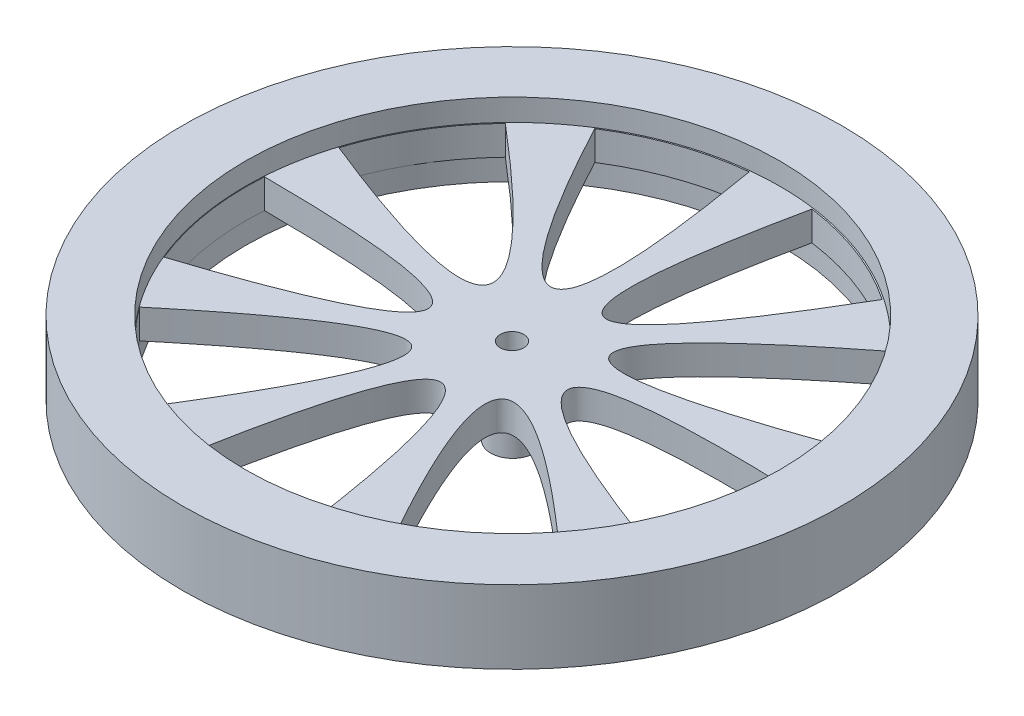
ISO-10303-21;
HEADER;
FILE_DESCRIPTION(('STEP AP214'),'2;1');
FILE_NAME('part.step','',(''),(''),'','','');
FILE_SCHEMA(('AUTOMOTIVE_DESIGN { 1 0 10303 214 1 1 1 1 }'));
ENDSEC;
DATA;
#1=APPLICATION_CONTEXT('core data for automotive mechanical design processes');
#2=APPLICATION_PROTOCOL_DEFINITION('international standard','automotive_design',2000,#1);
#3=PRODUCT_CONTEXT('',#1,'mechanical');
#4=PRODUCT('Part','Part','',(#3));
#5=PRODUCT_RELATED_PRODUCT_CATEGORY('part','',(#4));
#6=PRODUCT_DEFINITION_FORMATION('','',#4);
#7=PRODUCT_DEFINITION_CONTEXT('part definition',#1,'design');
#8=PRODUCT_DEFINITION('design','',#6,#7);
#9=PRODUCT_DEFINITION_SHAPE('','',#8);
#10=(LENGTH_UNIT() NAMED_UNIT(*) SI_UNIT(.MILLI.,.METRE.));
#11=(NAMED_UNIT(*) PLANE_ANGLE_UNIT() SI_UNIT($,.RADIAN.));
#12=(NAMED_UNIT(*) SI_UNIT($,.STERADIAN.) SOLID_ANGLE_UNIT());
#13=UNCERTAINTY_MEASURE_WITH_UNIT(LENGTH_MEASURE(1.E-05),#10,'distance_accuracy_value','');
#14=(GEOMETRIC_REPRESENTATION_CONTEXT(3) GLOBAL_UNCERTAINTY_ASSIGNED_CONTEXT((#13)) GLOBAL_UNIT_ASSIGNED_CONTEXT((#10,
#11,#12)) REPRESENTATION_CONTEXT('',''));
#15=CARTESIAN_POINT('',(0.,0.,0.));
#16=DIRECTION('',(0.,0.,1.));
#17=DIRECTION('',(1.,0.,0.));
#18=AXIS2_PLACEMENT_3D('',#15,#16,#17);
#19=CARTESIAN_POINT('',(0.,5.,0.0887249566365412));
#20=DIRECTION('',(0.,-1.,0.));
#21=DIRECTION('',(0.,0.,-1.));
#22=AXIS2_PLACEMENT_3D('',#19,#20,#21);
#23=CYLINDRICAL_SURFACE('',#22,1.6);
#24=CARTESIAN_POINT('',(0.,-9.8,0.0887249566365412));
#25=DIRECTION('',(0.,-1.,0.));
#26=DIRECTION('',(0.,0.,-1.));
#27=AXIS2_PLACEMENT_3D('',#24,#25,#26);
#28=CIRCLE('',#27,1.6);
#29=CARTESIAN_POINT('',(0.,-9.8,-1.51127504336346));
#30=VERTEX_POINT('',#29);
#31=EDGE_CURVE('E433',#30,#30,#28,.T.);
#32=ORIENTED_EDGE('',*,*,#31,.T.);
#33=EDGE_LOOP('',(#32));
#34=FACE_BOUND('',#33,.T.);
#35=CARTESIAN_POINT('',(0.,2.,0.0887249566365412));
#36=DIRECTION('',(0.,1.,0.));
#37=DIRECTION('',(0.,0.,1.));
#38=AXIS2_PLACEMENT_3D('',#35,#36,#37);
#39=CIRCLE('',#38,1.6);
#40=CARTESIAN_POINT('',(0.,2.,1.68872495663654));
#41=VERTEX_POINT('',#40);
#42=EDGE_CURVE('E472',#41,#41,#39,.T.);
#43=ORIENTED_EDGE('',*,*,#42,.T.);
#44=EDGE_LOOP('',(#43));
#45=FACE_BOUND('',#44,.T.);
#46=ADVANCED_FACE('F44',(#34,#45),#23,.F.);
#47=CARTESIAN_POINT('',(0.,5.,0.0887249566365412));
#48=DIRECTION('',(0.,1.,0.));
#49=DIRECTION('',(0.,0.,1.));
#50=AXIS2_PLACEMENT_3D('',#47,#48,#49);
#51=PLANE('',#50);
#52=CARTESIAN_POINT('',(0.,5.,0.));
#53=DIRECTION('',(0.,1.,0.));
#54=DIRECTION('',(0.,0.,1.));
#55=AXIS2_PLACEMENT_3D('',#52,#53,#54);
#56=CIRCLE('',#55,36.5014809236704);
#57=CARTESIAN_POINT('',(0.,5.,36.5014809236704));
#58=VERTEX_POINT('',#57);
#59=EDGE_CURVE('E461',#58,#58,#56,.T.);
#60=ORIENTED_EDGE('',*,*,#59,.F.);
#61=EDGE_LOOP('',(#60));
#62=FACE_BOUND('',#61,.T.);
#63=CARTESIAN_POINT('',(0.,5.,0.0887249566365412));
#64=DIRECTION('',(0.,1.,0.));
#65=DIRECTION('',(0.,0.,1.));
#66=AXIS2_PLACEMENT_3D('',#63,#64,#65);
#67=CIRCLE('',#66,45.);
#68=CARTESIAN_POINT('',(0.,5.,45.0887249566365));
#69=VERTEX_POINT('',#68);
#70=EDGE_CURVE('E474',#69,#69,#67,.T.);
#71=ORIENTED_EDGE('',*,*,#70,.T.);
#72=EDGE_LOOP('',(#71));
#73=FACE_BOUND('',#72,.T.);
#74=ADVANCED_FACE('F504',(#62,#73),#51,.T.);
#75=CARTESIAN_POINT('',(0.,-5.,0.0887249566365412));
#76=DIRECTION('',(0.,1.,0.));
#77=DIRECTION('',(0.,0.,1.));
#78=AXIS2_PLACEMENT_3D('',#75,#76,#77);
#79=PLANE('',#78);
#80=CARTESIAN_POINT('',(0.,-5.,0.));
#81=DIRECTION('',(0.,-1.,0.));
#82=DIRECTION('',(0.,0.,-1.));
#83=AXIS2_PLACEMENT_3D('',#80,#81,#82);
#84=CIRCLE('',#83,36.5014809236704);
#85=CARTESIAN_POINT('',(0.,-5.,-36.5014809236704));
#86=VERTEX_POINT('',#85);
#87=EDGE_CURVE('E462',#86,#86,#84,.T.);
#88=ORIENTED_EDGE('',*,*,#87,.F.);
#89=EDGE_LOOP('',(#88));
#90=FACE_BOUND('',#89,.T.);
#91=CARTESIAN_POINT('',(0.,-5.,0.0887249566365412));
#92=DIRECTION('',(0.,1.,0.));
#93=DIRECTION('',(0.,0.,1.));
#94=AXIS2_PLACEMENT_3D('',#91,#92,#93);
#95=CIRCLE('',#94,45.);
#96=CARTESIAN_POINT('',(0.,-5.,45.0887249566365));
#97=VERTEX_POINT('',#96);
#98=EDGE_CURVE('E477',#97,#97,#95,.T.);
#99=ORIENTED_EDGE('',*,*,#98,.F.);
#100=EDGE_LOOP('',(#99));
#101=FACE_BOUND('',#100,.T.);
#102=ADVANCED_FACE('F511',(#90,#101),#79,.F.);
#103=CARTESIAN_POINT('',(0.,5.,0.0887249566365412));
#104=DIRECTION('',(0.,-1.,0.));
#105=DIRECTION('',(0.,0.,-1.));
#106=AXIS2_PLACEMENT_3D('',#103,#104,#105);
#107=CYLINDRICAL_SURFACE('',#106,45.);
#108=ORIENTED_EDGE('',*,*,#70,.F.);
#109=EDGE_LOOP('',(#108));
#110=FACE_BOUND('',#109,.T.);
#111=ORIENTED_EDGE('',*,*,#98,.T.);
#112=EDGE_LOOP('',(#111));
#113=FACE_BOUND('',#112,.T.);
#114=ADVANCED_FACE('F46',(#110,#113),#107,.T.);
#115=CARTESIAN_POINT('',(0.,2.,0.));
#116=DIRECTION('',(0.,1.,0.));
#117=DIRECTION('',(0.,0.,1.));
#118=AXIS2_PLACEMENT_3D('',#115,#116,#117);
#119=CYLINDRICAL_SURFACE('',#118,36.5014809236704);
#120=DIRECTION('',(0.,-1.,0.));
#121=VECTOR('',#120,1.);
#122=CARTESIAN_POINT('',(-8.80159725878,8.,35.4244265347417));
#123=LINE('',#122,#121);
#124=CARTESIAN_POINT('',(-8.80159725878,2.,35.4244265347417));
#125=VERTEX_POINT('',#124);
#126=CARTESIAN_POINT('',(-8.80159725878001,-2.,35.4244265347417));
#127=VERTEX_POINT('',#126);
#128=EDGE_CURVE('E446',#125,#127,#123,.T.);
#129=ORIENTED_EDGE('',*,*,#128,.F.);
#130=CARTESIAN_POINT('',(0.,2.,0.));
#131=DIRECTION('',(0.,1.,0.));
#132=DIRECTION('',(0.,0.,1.));
#133=AXIS2_PLACEMENT_3D('',#130,#131,#132);
#134=CIRCLE('',#133,36.5014809236704);
#135=CARTESIAN_POINT('',(7.77143926148394,2.,35.6645880591118));
#136=VERTEX_POINT('',#135);
#137=EDGE_CURVE('E456',#136,#125,#134,.T.);
#138=ORIENTED_EDGE('',*,*,#137,.F.);
#139=DIRECTION('',(0.,-1.,0.));
#140=VECTOR('',#139,1.);
#141=CARTESIAN_POINT('',(7.77143926148394,8.,35.6645880591118));
#142=LINE('',#141,#140);
#143=CARTESIAN_POINT('',(7.77143926148394,-2.,35.6645880591118));
#144=VERTEX_POINT('',#143);
#145=EDGE_CURVE('E443',#136,#144,#142,.T.);
#146=ORIENTED_EDGE('',*,*,#145,.T.);
#147=CARTESIAN_POINT('',(0.,-2.,0.));
#148=DIRECTION('',(0.,-1.,0.));
#149=DIRECTION('',(0.,0.,-1.));
#150=AXIS2_PLACEMENT_3D('',#147,#148,#149);
#151=CIRCLE('',#150,36.5014809236704);
#152=EDGE_CURVE('E444',#127,#144,#151,.T.);
#153=ORIENTED_EDGE('',*,*,#152,.F.);
#154=EDGE_LOOP('',(#129,#138,#146,#153));
#155=FACE_BOUND('',#154,.T.);
#156=ORIENTED_EDGE('',*,*,#59,.T.);
#157=EDGE_LOOP('',(#156));
#158=FACE_BOUND('',#157,.T.);
#159=ORIENTED_EDGE('',*,*,#87,.T.);
#160=EDGE_LOOP('',(#159));
#161=FACE_BOUND('',#160,.T.);
#162=ADVANCED_FACE('F452',(#155,#158,#161),#119,.F.);
#163=CARTESIAN_POINT('',(0.,2.,0.));
#164=DIRECTION('',(0.,1.,0.));
#165=DIRECTION('',(0.,0.,1.));
#166=AXIS2_PLACEMENT_3D('',#163,#164,#165);
#167=PLANE('',#166);
#168=CARTESIAN_POINT('',(-29.4557658246465,2.,21.49988513086));
#169=CARTESIAN_POINT('',(10.6678043736023,2.,-11.8648802067777));
#170=CARTESIAN_POINT('',(-16.9144561448788,2.,32.3368020621628));
#171=B_SPLINE_CURVE_WITH_KNOTS('',2,(#168,#169,#170),.UNSPECIFIED.,.F.,.F.,(3,3),(0.,1.),.UNSPECIFIED.);
#172=CARTESIAN_POINT('',(-16.9144561448788,2.,32.3368020621628));
#173=VERTEX_POINT('',#172);
#174=CARTESIAN_POINT('',(-29.4557658246465,2.,21.49988513086));
#175=VERTEX_POINT('',#174);
#176=EDGE_CURVE('E171',#173,#175,#171,.F.);
#177=ORIENTED_EDGE('',*,*,#176,.F.);
#178=CARTESIAN_POINT('',(0.0570313027959434,2.,0.0207576966391458));
#179=DIRECTION('',(0.,1.,0.));
#180=DIRECTION('',(0.,0.,1.));
#181=AXIS2_PLACEMENT_3D('',#178,#179,#180);
#182=CIRCLE('',#181,36.5014809236704);
#183=EDGE_CURVE('E173',#175,#173,#182,.T.);
#184=ORIENTED_EDGE('',*,*,#183,.F.);
#185=EDGE_LOOP('',(#177,#184));
#186=FACE_BOUND('',#185,.T.);
#187=CARTESIAN_POINT('',(-36.3272541967891,2.,-2.44317607708021));
#188=CARTESIAN_POINT('',(15.8556415508061,2.,-2.21113538012383));
#189=CARTESIAN_POINT('',(-33.6858895378125,2.,13.9197823900828));
#190=B_SPLINE_CURVE_WITH_KNOTS('',2,(#187,#188,#189),.UNSPECIFIED.,.F.,.F.,(3,3),(0.,1.),.UNSPECIFIED.);
#191=CARTESIAN_POINT('',(-33.6858895378125,2.,13.9197823900828));
#192=VERTEX_POINT('',#191);
#193=CARTESIAN_POINT('',(-36.3272541967891,2.,-2.4431760770802));
#194=VERTEX_POINT('',#193);
#195=EDGE_CURVE('E237',#192,#194,#190,.F.);
#196=ORIENTED_EDGE('',*,*,#195,.F.);
#197=CARTESIAN_POINT('',(0.0873770251813376,2.,0.0733180296030275));
#198=DIRECTION('',(0.,1.,0.));
#199=DIRECTION('',(0.,0.,1.));
#200=AXIS2_PLACEMENT_3D('',#197,#198,#199);
#201=CIRCLE('',#200,36.5014809236704);
#202=EDGE_CURVE('E704',#194,#192,#201,.T.);
#203=ORIENTED_EDGE('',*,*,#202,.F.);
#204=EDGE_LOOP('',(#196,#203));
#205=FACE_BOUND('',#204,.T.);
#206=CARTESIAN_POINT('',(-26.2008165977952,2.,-25.2015326523988));
#207=CARTESIAN_POINT('',(13.6244478305604,2.,8.51873965820074));
#208=CARTESIAN_POINT('',(-34.6953208390431,2.,-10.9689427701879));
#209=B_SPLINE_CURVE_WITH_KNOTS('',2,(#206,#207,#208),.UNSPECIFIED.,.F.,.F.,(3,3),(0.,1.),.UNSPECIFIED.);
#210=CARTESIAN_POINT('',(-34.6953208390431,2.,-10.9689427701879));
#211=VERTEX_POINT('',#210);
#212=CARTESIAN_POINT('',(-26.2008165977952,2.,-25.2015326523987));
#213=VERTEX_POINT('',#212);
#214=EDGE_CURVE('E261',#211,#213,#209,.F.);
#215=ORIENTED_EDGE('',*,*,#214,.F.);
#216=CARTESIAN_POINT('',(0.0768380663969178,2.,0.133087434954811));
#217=DIRECTION('',(0.,1.,0.));
#218=DIRECTION('',(0.,0.,1.));
#219=AXIS2_PLACEMENT_3D('',#216,#217,#218);
#220=CIRCLE('',#219,36.5014809236704);
#221=EDGE_CURVE('E257',#213,#211,#220,.T.);
#222=ORIENTED_EDGE('',*,*,#221,.F.);
#223=EDGE_LOOP('',(#215,#222));
#224=FACE_BOUND('',#223,.T.);
#225=CARTESIAN_POINT('',(-3.81472572305179,2.,-36.1262966225446));
#226=CARTESIAN_POINT('',(5.01822355152437,2.,15.304117128486));
#227=CARTESIAN_POINT('',(-19.4704259241455,2.,-30.6836623087895));
#228=B_SPLINE_CURVE_WITH_KNOTS('',2,(#225,#226,#227),.UNSPECIFIED.,.F.,.F.,(3,3),(0.,1.),.UNSPECIFIED.);
#229=CARTESIAN_POINT('',(-19.4704259241455,2.,-30.6836623087895));
#230=VERTEX_POINT('',#229);
#231=CARTESIAN_POINT('',(-3.8147257230518,2.,-36.1262966225446));
#232=VERTEX_POINT('',#231);
#233=EDGE_CURVE('E300',#230,#232,#228,.F.);
#234=ORIENTED_EDGE('',*,*,#233,.F.);
#235=CARTESIAN_POINT('',(0.0303457223853942,2.,0.172099143667448));
#236=DIRECTION('',(0.,1.,0.));
#237=DIRECTION('',(0.,0.,1.));
#238=AXIS2_PLACEMENT_3D('',#235,#236,#237);
#239=CIRCLE('',#238,36.5014809236704);
#240=EDGE_CURVE('E772',#232,#230,#239,.T.);
#241=ORIENTED_EDGE('',*,*,#240,.F.);
#242=EDGE_LOOP('',(#234,#241));
#243=FACE_BOUND('',#242,.T.);
#244=CARTESIAN_POINT('',(20.3563177134615,2.,-30.1056495106592));
#245=CARTESIAN_POINT('',(-5.93608329861239,2.,14.9700435013149));
#246=CARTESIAN_POINT('',(4.86489767034039,2.,-35.9996398489086));
#247=B_SPLINE_CURVE_WITH_KNOTS('',2,(#244,#245,#246),.UNSPECIFIED.,.F.,.F.,(3,3),(0.,1.),.UNSPECIFIED.);
#248=CARTESIAN_POINT('',(4.86489767034039,2.,-35.9996398489086));
#249=VERTEX_POINT('',#248);
#250=CARTESIAN_POINT('',(20.3563177134614,2.,-30.1056495106592));
#251=VERTEX_POINT('',#250);
#252=EDGE_CURVE('E324',#249,#251,#247,.F.);
#253=ORIENTED_EDGE('',*,*,#252,.F.);
#254=CARTESIAN_POINT('',(-0.0303457223853931,2.,0.172099143667449));
#255=DIRECTION('',(0.,1.,0.));
#256=DIRECTION('',(0.,0.,1.));
#257=AXIS2_PLACEMENT_3D('',#254,#255,#256);
#258=CIRCLE('',#257,36.5014809236704);
#259=EDGE_CURVE('E320',#251,#249,#258,.T.);
#260=ORIENTED_EDGE('',*,*,#259,.F.);
#261=EDGE_LOOP('',(#253,#260));
#262=FACE_BOUND('',#261,.T.);
#263=CARTESIAN_POINT('',(35.0024138565749,2.,-9.95671901243322));
#264=CARTESIAN_POINT('',(-14.1128308011111,2.,7.6728355396555));
#265=CARTESIAN_POINT('',(26.923881577559,2.,-24.4294704190141));
#266=B_SPLINE_CURVE_WITH_KNOTS('',2,(#263,#264,#265),.UNSPECIFIED.,.F.,.F.,(3,3),(0.,1.),.UNSPECIFIED.);
#267=CARTESIAN_POINT('',(26.923881577559,2.,-24.4294704190141));
#268=VERTEX_POINT('',#267);
#269=CARTESIAN_POINT('',(35.0024138565749,2.,-9.95671901243323));
#270=VERTEX_POINT('',#269);
#271=EDGE_CURVE('E363',#268,#270,#266,.F.);
#272=ORIENTED_EDGE('',*,*,#271,.F.);
#273=CARTESIAN_POINT('',(-0.0768380663969172,2.,0.133087434954812));
#274=DIRECTION('',(0.,1.,0.));
#275=DIRECTION('',(0.,0.,1.));
#276=AXIS2_PLACEMENT_3D('',#273,#274,#275);
#277=CIRCLE('',#276,36.5014809236704);
#278=EDGE_CURVE('E756',#270,#268,#277,.T.);
#279=ORIENTED_EDGE('',*,*,#278,.F.);
#280=EDGE_LOOP('',(#272,#279));
#281=FACE_BOUND('',#280,.T.);
#282=CARTESIAN_POINT('',(33.2704915476983,2.,14.8925863615944));
#283=CARTESIAN_POINT('',(-15.6860279251267,2.,-3.17306205179878));
#284=CARTESIAN_POINT('',(36.3848820690245,2.,-1.38696488346341));
#285=B_SPLINE_CURVE_WITH_KNOTS('',2,(#282,#283,#284),.UNSPECIFIED.,.F.,.F.,(3,3),(0.,1.),.UNSPECIFIED.);
#286=CARTESIAN_POINT('',(36.3848820690245,2.,-1.38696488346341));
#287=VERTEX_POINT('',#286);
#288=CARTESIAN_POINT('',(33.2704915476983,2.,14.8925863615944));
#289=VERTEX_POINT('',#288);
#290=EDGE_CURVE('E387',#287,#289,#285,.F.);
#291=ORIENTED_EDGE('',*,*,#290,.F.);
#292=CARTESIAN_POINT('',(-0.0873770251813378,2.,0.0733180296030287));
#293=DIRECTION('',(0.,1.,0.));
#294=DIRECTION('',(0.,0.,1.));
#295=AXIS2_PLACEMENT_3D('',#292,#293,#294);
#296=CIRCLE('',#295,36.5014809236704);
#297=EDGE_CURVE('E383',#289,#287,#296,.T.);
#298=ORIENTED_EDGE('',*,*,#297,.F.);
#299=EDGE_LOOP('',(#291,#298));
#300=FACE_BOUND('',#299,.T.);
#301=CARTESIAN_POINT('',(15.9709364833275,2.,32.8150004576493));
#302=CARTESIAN_POINT('',(-9.91955825219364,2.,-12.4927332512815));
#303=CARTESIAN_POINT('',(28.8209918674721,2.,22.3460323287358));
#304=B_SPLINE_CURVE_WITH_KNOTS('',2,(#301,#302,#303),.UNSPECIFIED.,.F.,.F.,(3,3),(0.,1.),.UNSPECIFIED.);
#305=CARTESIAN_POINT('',(28.8209918674721,2.,22.3460323287358));
#306=VERTEX_POINT('',#305);
#307=CARTESIAN_POINT('',(15.9709364833275,2.,32.8150004576492));
#308=VERTEX_POINT('',#307);
#309=EDGE_CURVE('E422',#306,#308,#304,.F.);
#310=ORIENTED_EDGE('',*,*,#309,.F.);
#311=CARTESIAN_POINT('',(-0.0570313027959443,2.,0.0207576966391466));
#312=DIRECTION('',(0.,1.,0.));
#313=DIRECTION('',(0.,0.,1.));
#314=AXIS2_PLACEMENT_3D('',#311,#312,#313);
#315=CIRCLE('',#314,36.5014809236704);
#316=EDGE_CURVE('E740',#308,#306,#315,.T.);
#317=ORIENTED_EDGE('',*,*,#316,.F.);
#318=EDGE_LOOP('',(#310,#317));
#319=FACE_BOUND('',#318,.T.);
#320=CARTESIAN_POINT('',(-8.80159725878001,2.,35.4244265347417));
#321=CARTESIAN_POINT('',(0.488382970550821,2.,-15.9254003279467));
#322=CARTESIAN_POINT('',(7.77143926148394,2.,35.6645880591118));
#323=B_SPLINE_CURVE_WITH_KNOTS('',2,(#320,#321,#322),.UNSPECIFIED.,.F.,.F.,(3,3),(0.,1.),.UNSPECIFIED.);
#324=EDGE_CURVE('E12',#136,#125,#323,.F.);
#325=ORIENTED_EDGE('',*,*,#324,.F.);
#326=ORIENTED_EDGE('',*,*,#137,.T.);
#327=EDGE_LOOP('',(#325,#326));
#328=FACE_BOUND('',#327,.T.);
#329=ORIENTED_EDGE('',*,*,#42,.F.);
#330=EDGE_LOOP('',(#329));
#331=FACE_BOUND('',#330,.T.);
#332=ADVANCED_FACE('F494',(#186,#205,#224,#243,#262,#281,#300,#319,#328,#331),#167,.T.);
#333=CARTESIAN_POINT('',(0.,-2.,0.));
#334=DIRECTION('',(0.,-1.,0.));
#335=DIRECTION('',(0.,0.,-1.));
#336=AXIS2_PLACEMENT_3D('',#333,#334,#335);
#337=PLANE('',#336);
#338=CARTESIAN_POINT('',(-29.4557658246465,-2.,21.49988513086));
#339=CARTESIAN_POINT('',(10.6678043736023,-2.,-11.8648802067777));
#340=CARTESIAN_POINT('',(-16.9144561448788,-2.,32.3368020621628));
#341=B_SPLINE_CURVE_WITH_KNOTS('',2,(#338,#339,#340),.UNSPECIFIED.,.F.,.F.,(3,3),(0.,1.),.UNSPECIFIED.);
#342=CARTESIAN_POINT('',(-29.4557658246465,-2.,21.49988513086));
#343=VERTEX_POINT('',#342);
#344=CARTESIAN_POINT('',(-16.9144561448788,-2.,32.3368020621628));
#345=VERTEX_POINT('',#344);
#346=EDGE_CURVE('E68',#343,#345,#341,.T.);
#347=ORIENTED_EDGE('',*,*,#346,.F.);
#348=CARTESIAN_POINT('',(0.0570313027959434,-2.,0.0207576966391458));
#349=DIRECTION('',(0.,-1.,0.));
#350=DIRECTION('',(0.64278760968653,0.,-0.766044443118986));
#351=AXIS2_PLACEMENT_3D('',#348,#349,#350);
#352=CIRCLE('',#351,36.5014809236704);
#353=EDGE_CURVE('E177',#345,#343,#352,.T.);
#354=ORIENTED_EDGE('',*,*,#353,.F.);
#355=EDGE_LOOP('',(#347,#354));
#356=FACE_BOUND('',#355,.T.);
#357=CARTESIAN_POINT('',(-36.3272541967891,-2.,-2.44317607708021));
#358=CARTESIAN_POINT('',(15.8556415508061,-2.,-2.21113538012383));
#359=CARTESIAN_POINT('',(-33.6858895378125,-2.,13.9197823900828));
#360=B_SPLINE_CURVE_WITH_KNOTS('',2,(#357,#358,#359),.UNSPECIFIED.,.F.,.F.,(3,3),(0.,1.),.UNSPECIFIED.);
#361=CARTESIAN_POINT('',(-36.3272541967891,-2.,-2.4431760770802));
#362=VERTEX_POINT('',#361);
#363=CARTESIAN_POINT('',(-33.6858895378125,-2.,13.9197823900828));
#364=VERTEX_POINT('',#363);
#365=EDGE_CURVE('E199',#362,#364,#360,.T.);
#366=ORIENTED_EDGE('',*,*,#365,.F.);
#367=CARTESIAN_POINT('',(0.0873770251813376,-2.,0.0733180296030275));
#368=DIRECTION('',(0.,-1.,0.));
#369=DIRECTION('',(0.984807753012206,0.,-0.17364817766694));
#370=AXIS2_PLACEMENT_3D('',#367,#368,#369);
#371=CIRCLE('',#370,36.5014809236704);
#372=EDGE_CURVE('E714',#364,#362,#371,.T.);
#373=ORIENTED_EDGE('',*,*,#372,.F.);
#374=EDGE_LOOP('',(#366,#373));
#375=FACE_BOUND('',#374,.T.);
#376=CARTESIAN_POINT('',(-26.2008165977952,-2.,-25.2015326523988));
#377=CARTESIAN_POINT('',(13.6244478305604,-2.,8.51873965820074));
#378=CARTESIAN_POINT('',(-34.6953208390431,-2.,-10.9689427701879));
#379=B_SPLINE_CURVE_WITH_KNOTS('',2,(#376,#377,#378),.UNSPECIFIED.,.F.,.F.,(3,3),(0.,1.),.UNSPECIFIED.);
#380=CARTESIAN_POINT('',(-26.2008165977952,-2.,-25.2015326523987));
#381=VERTEX_POINT('',#380);
#382=CARTESIAN_POINT('',(-34.6953208390431,-2.,-10.9689427701879));
#383=VERTEX_POINT('',#382);
#384=EDGE_CURVE('E241',#381,#383,#379,.T.);
#385=ORIENTED_EDGE('',*,*,#384,.F.);
#386=CARTESIAN_POINT('',(0.0768380663969178,-2.,0.133087434954811));
#387=DIRECTION('',(0.,-1.,0.));
#388=DIRECTION('',(0.866025403784443,0.,0.499999999999992));
#389=AXIS2_PLACEMENT_3D('',#386,#387,#388);
#390=CIRCLE('',#389,36.5014809236704);
#391=EDGE_CURVE('E248',#383,#381,#390,.T.);
#392=ORIENTED_EDGE('',*,*,#391,.F.);
#393=EDGE_LOOP('',(#385,#392));
#394=FACE_BOUND('',#393,.T.);
#395=CARTESIAN_POINT('',(-3.81472572305179,-2.,-36.1262966225446));
#396=CARTESIAN_POINT('',(5.01822355152437,-2.,15.304117128486));
#397=CARTESIAN_POINT('',(-19.4704259241455,-2.,-30.6836623087895));
#398=B_SPLINE_CURVE_WITH_KNOTS('',2,(#395,#396,#397),.UNSPECIFIED.,.F.,.F.,(3,3),(0.,1.),.UNSPECIFIED.);
#399=CARTESIAN_POINT('',(-3.8147257230518,-2.,-36.1262966225446));
#400=VERTEX_POINT('',#399);
#401=CARTESIAN_POINT('',(-19.4704259241455,-2.,-30.6836623087895));
#402=VERTEX_POINT('',#401);
#403=EDGE_CURVE('E266',#400,#402,#398,.T.);
#404=ORIENTED_EDGE('',*,*,#403,.F.);
#405=CARTESIAN_POINT('',(0.0303457223853942,-2.,0.172099143667448));
#406=DIRECTION('',(0.,-1.,0.));
#407=DIRECTION('',(0.342020143325676,0.,0.939692620785906));
#408=AXIS2_PLACEMENT_3D('',#405,#406,#407);
#409=CIRCLE('',#408,36.5014809236704);
#410=EDGE_CURVE('E779',#402,#400,#409,.T.);
#411=ORIENTED_EDGE('',*,*,#410,.F.);
#412=EDGE_LOOP('',(#404,#411));
#413=FACE_BOUND('',#412,.T.);
#414=CARTESIAN_POINT('',(20.3563177134615,-2.,-30.1056495106592));
#415=CARTESIAN_POINT('',(-5.93608329861239,-2.,14.9700435013149));
#416=CARTESIAN_POINT('',(4.86489767034039,-2.,-35.9996398489086));
#417=B_SPLINE_CURVE_WITH_KNOTS('',2,(#414,#415,#416),.UNSPECIFIED.,.F.,.F.,(3,3),(0.,1.),.UNSPECIFIED.);
#418=CARTESIAN_POINT('',(20.3563177134614,-2.,-30.1056495106592));
#419=VERTEX_POINT('',#418);
#420=CARTESIAN_POINT('',(4.86489767034039,-2.,-35.9996398489086));
#421=VERTEX_POINT('',#420);
#422=EDGE_CURVE('E304',#419,#421,#417,.T.);
#423=ORIENTED_EDGE('',*,*,#422,.F.);
#424=CARTESIAN_POINT('',(-0.0303457223853931,-2.,0.172099143667449));
#425=DIRECTION('',(0.,-1.,0.));
#426=DIRECTION('',(-0.342020143325663,0.,0.939692620785911));
#427=AXIS2_PLACEMENT_3D('',#424,#425,#426);
#428=CIRCLE('',#427,36.5014809236704);
#429=EDGE_CURVE('E311',#421,#419,#428,.T.);
#430=ORIENTED_EDGE('',*,*,#429,.F.);
#431=EDGE_LOOP('',(#423,#430));
#432=FACE_BOUND('',#431,.T.);
#433=CARTESIAN_POINT('',(35.0024138565749,-2.,-9.95671901243322));
#434=CARTESIAN_POINT('',(-14.1128308011111,-2.,7.6728355396555));
#435=CARTESIAN_POINT('',(26.923881577559,-2.,-24.4294704190141));
#436=B_SPLINE_CURVE_WITH_KNOTS('',2,(#433,#434,#435),.UNSPECIFIED.,.F.,.F.,(3,3),(0.,1.),.UNSPECIFIED.);
#437=CARTESIAN_POINT('',(35.0024138565749,-2.,-9.95671901243323));
#438=VERTEX_POINT('',#437);
#439=CARTESIAN_POINT('',(26.923881577559,-2.,-24.4294704190141));
#440=VERTEX_POINT('',#439);
#441=EDGE_CURVE('E329',#438,#440,#436,.T.);
#442=ORIENTED_EDGE('',*,*,#441,.F.);
#443=CARTESIAN_POINT('',(-0.0768380663969172,-2.,0.133087434954812));
#444=DIRECTION('',(0.,-1.,0.));
#445=DIRECTION('',(-0.866025403784436,0.,0.500000000000004));
#446=AXIS2_PLACEMENT_3D('',#443,#444,#445);
#447=CIRCLE('',#446,36.5014809236704);
#448=EDGE_CURVE('E763',#440,#438,#447,.T.);
#449=ORIENTED_EDGE('',*,*,#448,.F.);
#450=EDGE_LOOP('',(#442,#449));
#451=FACE_BOUND('',#450,.T.);
#452=CARTESIAN_POINT('',(33.2704915476983,-2.,14.8925863615944));
#453=CARTESIAN_POINT('',(-15.6860279251267,-2.,-3.17306205179878));
#454=CARTESIAN_POINT('',(36.3848820690245,-2.,-1.38696488346341));
#455=B_SPLINE_CURVE_WITH_KNOTS('',2,(#452,#453,#454),.UNSPECIFIED.,.F.,.F.,(3,3),(0.,1.),.UNSPECIFIED.);
#456=CARTESIAN_POINT('',(33.2704915476983,-2.,14.8925863615944));
#457=VERTEX_POINT('',#456);
#458=CARTESIAN_POINT('',(36.3848820690245,-2.,-1.38696488346341));
#459=VERTEX_POINT('',#458);
#460=EDGE_CURVE('E367',#457,#459,#455,.T.);
#461=ORIENTED_EDGE('',*,*,#460,.F.);
#462=CARTESIAN_POINT('',(-0.0873770251813378,-2.,0.0733180296030287));
#463=DIRECTION('',(0.,-1.,0.));
#464=DIRECTION('',(-0.984807753012209,0.,-0.173648177666927));
#465=AXIS2_PLACEMENT_3D('',#462,#463,#464);
#466=CIRCLE('',#465,36.5014809236704);
#467=EDGE_CURVE('E374',#459,#457,#466,.T.);
#468=ORIENTED_EDGE('',*,*,#467,.F.);
#469=EDGE_LOOP('',(#461,#468));
#470=FACE_BOUND('',#469,.T.);
#471=CARTESIAN_POINT('',(15.9709364833275,-2.,32.8150004576493));
#472=CARTESIAN_POINT('',(-9.91955825219364,-2.,-12.4927332512815));
#473=CARTESIAN_POINT('',(28.8209918674721,-2.,22.3460323287358));
#474=B_SPLINE_CURVE_WITH_KNOTS('',2,(#471,#472,#473),.UNSPECIFIED.,.F.,.F.,(3,3),(0.,1.),.UNSPECIFIED.);
#475=CARTESIAN_POINT('',(15.9709364833275,-2.,32.8150004576493));
#476=VERTEX_POINT('',#475);
#477=CARTESIAN_POINT('',(28.8209918674721,-2.,22.3460323287358));
#478=VERTEX_POINT('',#477);
#479=EDGE_CURVE('E392',#476,#478,#474,.T.);
#480=ORIENTED_EDGE('',*,*,#479,.F.);
#481=CARTESIAN_POINT('',(-0.0570313027959443,-2.,0.0207576966391466));
#482=DIRECTION('',(0.,-1.,0.));
#483=DIRECTION('',(-0.642787609686541,0.,-0.766044443118977));
#484=AXIS2_PLACEMENT_3D('',#481,#482,#483);
#485=CIRCLE('',#484,36.5014809236704);
#486=EDGE_CURVE('E747',#478,#476,#485,.T.);
#487=ORIENTED_EDGE('',*,*,#486,.F.);
#488=EDGE_LOOP('',(#480,#487));
#489=FACE_BOUND('',#488,.T.);
#490=CARTESIAN_POINT('',(-8.80159725878001,-2.,35.4244265347417));
#491=CARTESIAN_POINT('',(0.488382970550821,-2.,-15.9254003279467));
#492=CARTESIAN_POINT('',(7.77143926148394,-2.,35.6645880591118));
#493=B_SPLINE_CURVE_WITH_KNOTS('',2,(#490,#491,#492),.UNSPECIFIED.,.F.,.F.,(3,3),(0.,1.),.UNSPECIFIED.);
#494=EDGE_CURVE('E439',#127,#144,#493,.T.);
#495=ORIENTED_EDGE('',*,*,#494,.F.);
#496=ORIENTED_EDGE('',*,*,#152,.T.);
#497=EDGE_LOOP('',(#495,#496));
#498=FACE_BOUND('',#497,.T.);
#499=CARTESIAN_POINT('',(0.,-2.,0.));
#500=DIRECTION('',(0.,-1.,0.));
#501=DIRECTION('',(0.,0.,-1.));
#502=AXIS2_PLACEMENT_3D('',#499,#500,#501);
#503=CIRCLE('',#502,3.);
#504=CARTESIAN_POINT('',(0.,-2.,-3.));
#505=VERTEX_POINT('',#504);
#506=EDGE_CURVE('E53',#505,#505,#503,.T.);
#507=ORIENTED_EDGE('',*,*,#506,.F.);
#508=EDGE_LOOP('',(#507));
#509=FACE_BOUND('',#508,.T.);
#510=ADVANCED_FACE('F181',(#356,#375,#394,#413,#432,#451,#470,#489,#498,#509),#337,.T.);
#511=CARTESIAN_POINT('',(0.,-1.,0.));
#512=DIRECTION('',(0.,-1.,0.));
#513=DIRECTION('',(0.,0.,-1.));
#514=AXIS2_PLACEMENT_3D('',#511,#512,#513);
#515=CYLINDRICAL_SURFACE('',#514,3.);
#516=ORIENTED_EDGE('',*,*,#506,.T.);
#517=EDGE_LOOP('',(#516));
#518=FACE_BOUND('',#517,.T.);
#519=CARTESIAN_POINT('',(0.,-9.8,0.));
#520=DIRECTION('',(0.,-1.,0.));
#521=DIRECTION('',(0.,0.,-1.));
#522=AXIS2_PLACEMENT_3D('',#519,#520,#521);
#523=CIRCLE('',#522,3.);
#524=CARTESIAN_POINT('',(0.,-9.8,-3.));
#525=VERTEX_POINT('',#524);
#526=EDGE_CURVE('E466',#525,#525,#523,.T.);
#527=ORIENTED_EDGE('',*,*,#526,.F.);
#528=EDGE_LOOP('',(#527));
#529=FACE_BOUND('',#528,.T.);
#530=ADVANCED_FACE('F491',(#518,#529),#515,.T.);
#531=CARTESIAN_POINT('',(0.,-9.8,0.));
#532=DIRECTION('',(0.,-1.,0.));
#533=DIRECTION('',(0.,0.,-1.));
#534=AXIS2_PLACEMENT_3D('',#531,#532,#533);
#535=PLANE('',#534);
#536=ORIENTED_EDGE('',*,*,#526,.T.);
#537=EDGE_LOOP('',(#536));
#538=FACE_BOUND('',#537,.T.);
#539=ORIENTED_EDGE('',*,*,#31,.F.);
#540=EDGE_LOOP('',(#539));
#541=FACE_BOUND('',#540,.T.);
#542=ADVANCED_FACE('F414',(#538,#541),#535,.T.);
#543=CARTESIAN_POINT('',(-8.80159725878001,8.,35.4244265347417));
#544=CARTESIAN_POINT('',(0.488382970550821,8.,-15.9254003279467));
#545=CARTESIAN_POINT('',(7.77143926148394,8.,35.6645880591118));
#546=B_SPLINE_CURVE_WITH_KNOTS('',2,(#543,#544,#545),.UNSPECIFIED.,.F.,.F.,(3,3),(0.,1.),.UNSPECIFIED.);
#547=DIRECTION('',(0.,-1.,0.));
#548=VECTOR('',#547,1.);
#549=SURFACE_OF_LINEAR_EXTRUSION('',#546,#548);
#550=ORIENTED_EDGE('',*,*,#324,.T.);
#551=ORIENTED_EDGE('',*,*,#128,.T.);
#552=ORIENTED_EDGE('',*,*,#494,.T.);
#553=ORIENTED_EDGE('',*,*,#145,.F.);
#554=EDGE_LOOP('',(#550,#551,#552,#553));
#555=FACE_BOUND('',#554,.T.);
#556=ADVANCED_FACE('F409',(#555),#549,.F.);
#557=CARTESIAN_POINT('',(15.9709364833275,8.,32.8150004576493));
#558=CARTESIAN_POINT('',(-9.91955825219364,8.,-12.4927332512815));
#559=CARTESIAN_POINT('',(28.8209918674721,8.,22.3460323287358));
#560=B_SPLINE_CURVE_WITH_KNOTS('',2,(#557,#558,#559),.UNSPECIFIED.,.F.,.F.,(3,3),(0.,1.),.UNSPECIFIED.);
#561=DIRECTION('',(0.,-1.,0.));
#562=VECTOR('',#561,1.);
#563=SURFACE_OF_LINEAR_EXTRUSION('',#560,#562);
#564=ORIENTED_EDGE('',*,*,#309,.T.);
#565=DIRECTION('',(0.,-1.,0.));
#566=VECTOR('',#565,1.);
#567=CARTESIAN_POINT('',(15.9709364833275,8.,32.8150004576493));
#568=LINE('',#567,#566);
#569=EDGE_CURVE('E742',#308,#476,#568,.T.);
#570=ORIENTED_EDGE('',*,*,#569,.T.);
#571=ORIENTED_EDGE('',*,*,#479,.T.);
#572=DIRECTION('',(0.,-1.,0.));
#573=VECTOR('',#572,1.);
#574=CARTESIAN_POINT('',(28.8209918674721,8.,22.3460323287358));
#575=LINE('',#574,#573);
#576=EDGE_CURVE('E744',#306,#478,#575,.T.);
#577=ORIENTED_EDGE('',*,*,#576,.F.);
#578=EDGE_LOOP('',(#564,#570,#571,#577));
#579=FACE_BOUND('',#578,.T.);
#580=ADVANCED_FACE('F406',(#579),#563,.F.);
#581=CARTESIAN_POINT('',(-0.0570313027959443,8.,0.0207576966391466));
#582=DIRECTION('',(0.,-1.,0.));
#583=DIRECTION('',(0.,0.,-1.));
#584=AXIS2_PLACEMENT_3D('',#581,#582,#583);
#585=CYLINDRICAL_SURFACE('',#584,36.5014809236704);
#586=ORIENTED_EDGE('',*,*,#316,.T.);
#587=ORIENTED_EDGE('',*,*,#576,.T.);
#588=ORIENTED_EDGE('',*,*,#486,.T.);
#589=ORIENTED_EDGE('',*,*,#569,.F.);
#590=EDGE_LOOP('',(#586,#587,#588,#589));
#591=FACE_BOUND('',#590,.T.);
#592=ADVANCED_FACE('F355',(#591),#585,.F.);
#593=CARTESIAN_POINT('',(33.2704915476983,8.,14.8925863615944));
#594=CARTESIAN_POINT('',(-15.6860279251267,8.,-3.17306205179878));
#595=CARTESIAN_POINT('',(36.3848820690245,8.,-1.38696488346341));
#596=B_SPLINE_CURVE_WITH_KNOTS('',2,(#593,#594,#595),.UNSPECIFIED.,.F.,.F.,(3,3),(0.,1.),.UNSPECIFIED.);
#597=DIRECTION('',(0.,-1.,0.));
#598=VECTOR('',#597,1.);
#599=SURFACE_OF_LINEAR_EXTRUSION('',#596,#598);
#600=ORIENTED_EDGE('',*,*,#290,.T.);
#601=DIRECTION('',(0.,-1.,0.));
#602=VECTOR('',#601,1.);
#603=CARTESIAN_POINT('',(33.2704915476983,8.,14.8925863615944));
#604=LINE('',#603,#602);
#605=EDGE_CURVE('E381',#289,#457,#604,.T.);
#606=ORIENTED_EDGE('',*,*,#605,.T.);
#607=ORIENTED_EDGE('',*,*,#460,.T.);
#608=DIRECTION('',(0.,-1.,0.));
#609=VECTOR('',#608,1.);
#610=CARTESIAN_POINT('',(36.3848820690245,8.,-1.38696488346341));
#611=LINE('',#610,#609);
#612=EDGE_CURVE('E380',#287,#459,#611,.T.);
#613=ORIENTED_EDGE('',*,*,#612,.F.);
#614=EDGE_LOOP('',(#600,#606,#607,#613));
#615=FACE_BOUND('',#614,.T.);
#616=ADVANCED_FACE('F350',(#615),#599,.F.);
#617=CARTESIAN_POINT('',(-0.0873770251813378,8.,0.0733180296030287));
#618=DIRECTION('',(0.,-1.,0.));
#619=DIRECTION('',(0.,0.,-1.));
#620=AXIS2_PLACEMENT_3D('',#617,#618,#619);
#621=CYLINDRICAL_SURFACE('',#620,36.5014809236704);
#622=ORIENTED_EDGE('',*,*,#297,.T.);
#623=ORIENTED_EDGE('',*,*,#612,.T.);
#624=ORIENTED_EDGE('',*,*,#467,.T.);
#625=ORIENTED_EDGE('',*,*,#605,.F.);
#626=EDGE_LOOP('',(#622,#623,#624,#625));
#627=FACE_BOUND('',#626,.T.);
#628=ADVANCED_FACE('F346',(#627),#621,.F.);
#629=CARTESIAN_POINT('',(35.0024138565749,8.,-9.95671901243322));
#630=CARTESIAN_POINT('',(-14.1128308011111,8.,7.6728355396555));
#631=CARTESIAN_POINT('',(26.923881577559,8.,-24.4294704190141));
#632=B_SPLINE_CURVE_WITH_KNOTS('',2,(#629,#630,#631),.UNSPECIFIED.,.F.,.F.,(3,3),(0.,1.),.UNSPECIFIED.);
#633=DIRECTION('',(0.,-1.,0.));
#634=VECTOR('',#633,1.);
#635=SURFACE_OF_LINEAR_EXTRUSION('',#632,#634);
#636=ORIENTED_EDGE('',*,*,#271,.T.);
#637=DIRECTION('',(0.,-1.,0.));
#638=VECTOR('',#637,1.);
#639=CARTESIAN_POINT('',(35.0024138565749,8.,-9.95671901243323));
#640=LINE('',#639,#638);
#641=EDGE_CURVE('E758',#270,#438,#640,.T.);
#642=ORIENTED_EDGE('',*,*,#641,.T.);
#643=ORIENTED_EDGE('',*,*,#441,.T.);
#644=DIRECTION('',(0.,-1.,0.));
#645=VECTOR('',#644,1.);
#646=CARTESIAN_POINT('',(26.923881577559,8.,-24.4294704190141));
#647=LINE('',#646,#645);
#648=EDGE_CURVE('E760',#268,#440,#647,.T.);
#649=ORIENTED_EDGE('',*,*,#648,.F.);
#650=EDGE_LOOP('',(#636,#642,#643,#649));
#651=FACE_BOUND('',#650,.T.);
#652=ADVANCED_FACE('F343',(#651),#635,.F.);
#653=CARTESIAN_POINT('',(-0.0768380663969172,8.,0.133087434954812));
#654=DIRECTION('',(0.,-1.,0.));
#655=DIRECTION('',(0.,0.,-1.));
#656=AXIS2_PLACEMENT_3D('',#653,#654,#655);
#657=CYLINDRICAL_SURFACE('',#656,36.5014809236704);
#658=ORIENTED_EDGE('',*,*,#278,.T.);
#659=ORIENTED_EDGE('',*,*,#648,.T.);
#660=ORIENTED_EDGE('',*,*,#448,.T.);
#661=ORIENTED_EDGE('',*,*,#641,.F.);
#662=EDGE_LOOP('',(#658,#659,#660,#661));
#663=FACE_BOUND('',#662,.T.);
#664=ADVANCED_FACE('F292',(#663),#657,.F.);
#665=CARTESIAN_POINT('',(20.3563177134615,8.,-30.1056495106592));
#666=CARTESIAN_POINT('',(-5.93608329861239,8.,14.9700435013149));
#667=CARTESIAN_POINT('',(4.86489767034039,8.,-35.9996398489086));
#668=B_SPLINE_CURVE_WITH_KNOTS('',2,(#665,#666,#667),.UNSPECIFIED.,.F.,.F.,(3,3),(0.,1.),.UNSPECIFIED.);
#669=DIRECTION('',(0.,-1.,0.));
#670=VECTOR('',#669,1.);
#671=SURFACE_OF_LINEAR_EXTRUSION('',#668,#670);
#672=ORIENTED_EDGE('',*,*,#252,.T.);
#673=DIRECTION('',(0.,-1.,0.));
#674=VECTOR('',#673,1.);
#675=CARTESIAN_POINT('',(20.3563177134614,8.,-30.1056495106592));
#676=LINE('',#675,#674);
#677=EDGE_CURVE('E318',#251,#419,#676,.T.);
#678=ORIENTED_EDGE('',*,*,#677,.T.);
#679=ORIENTED_EDGE('',*,*,#422,.T.);
#680=DIRECTION('',(0.,-1.,0.));
#681=VECTOR('',#680,1.);
#682=CARTESIAN_POINT('',(4.86489767034039,8.,-35.9996398489086));
#683=LINE('',#682,#681);
#684=EDGE_CURVE('E317',#249,#421,#683,.T.);
#685=ORIENTED_EDGE('',*,*,#684,.F.);
#686=EDGE_LOOP('',(#672,#678,#679,#685));
#687=FACE_BOUND('',#686,.T.);
#688=ADVANCED_FACE('F287',(#687),#671,.F.);
#689=CARTESIAN_POINT('',(-0.0303457223853931,8.,0.172099143667449));
#690=DIRECTION('',(0.,-1.,0.));
#691=DIRECTION('',(0.,0.,-1.));
#692=AXIS2_PLACEMENT_3D('',#689,#690,#691);
#693=CYLINDRICAL_SURFACE('',#692,36.5014809236704);
#694=ORIENTED_EDGE('',*,*,#259,.T.);
#695=ORIENTED_EDGE('',*,*,#684,.T.);
#696=ORIENTED_EDGE('',*,*,#429,.T.);
#697=ORIENTED_EDGE('',*,*,#677,.F.);
#698=EDGE_LOOP('',(#694,#695,#696,#697));
#699=FACE_BOUND('',#698,.T.);
#700=ADVANCED_FACE('F283',(#699),#693,.F.);
#701=CARTESIAN_POINT('',(-3.81472572305179,8.,-36.1262966225446));
#702=CARTESIAN_POINT('',(5.01822355152437,8.,15.304117128486));
#703=CARTESIAN_POINT('',(-19.4704259241455,8.,-30.6836623087895));
#704=B_SPLINE_CURVE_WITH_KNOTS('',2,(#701,#702,#703),.UNSPECIFIED.,.F.,.F.,(3,3),(0.,1.),.UNSPECIFIED.);
#705=DIRECTION('',(0.,-1.,0.));
#706=VECTOR('',#705,1.);
#707=SURFACE_OF_LINEAR_EXTRUSION('',#704,#706);
#708=ORIENTED_EDGE('',*,*,#233,.T.);
#709=DIRECTION('',(0.,-1.,0.));
#710=VECTOR('',#709,1.);
#711=CARTESIAN_POINT('',(-3.8147257230518,8.,-36.1262966225446));
#712=LINE('',#711,#710);
#713=EDGE_CURVE('E774',#232,#400,#712,.T.);
#714=ORIENTED_EDGE('',*,*,#713,.T.);
#715=ORIENTED_EDGE('',*,*,#403,.T.);
#716=DIRECTION('',(0.,-1.,0.));
#717=VECTOR('',#716,1.);
#718=CARTESIAN_POINT('',(-19.4704259241455,8.,-30.6836623087895));
#719=LINE('',#718,#717);
#720=EDGE_CURVE('E776',#230,#402,#719,.T.);
#721=ORIENTED_EDGE('',*,*,#720,.F.);
#722=EDGE_LOOP('',(#708,#714,#715,#721));
#723=FACE_BOUND('',#722,.T.);
#724=ADVANCED_FACE('F280',(#723),#707,.F.);
#725=CARTESIAN_POINT('',(0.0303457223853942,8.,0.172099143667448));
#726=DIRECTION('',(0.,-1.,0.));
#727=DIRECTION('',(0.,0.,-1.));
#728=AXIS2_PLACEMENT_3D('',#725,#726,#727);
#729=CYLINDRICAL_SURFACE('',#728,36.5014809236704);
#730=ORIENTED_EDGE('',*,*,#240,.T.);
#731=ORIENTED_EDGE('',*,*,#720,.T.);
#732=ORIENTED_EDGE('',*,*,#410,.T.);
#733=ORIENTED_EDGE('',*,*,#713,.F.);
#734=EDGE_LOOP('',(#730,#731,#732,#733));
#735=FACE_BOUND('',#734,.T.);
#736=ADVANCED_FACE('F229',(#735),#729,.F.);
#737=CARTESIAN_POINT('',(-26.2008165977952,8.,-25.2015326523988));
#738=CARTESIAN_POINT('',(13.6244478305604,8.,8.51873965820074));
#739=CARTESIAN_POINT('',(-34.6953208390431,8.,-10.9689427701879));
#740=B_SPLINE_CURVE_WITH_KNOTS('',2,(#737,#738,#739),.UNSPECIFIED.,.F.,.F.,(3,3),(0.,1.),.UNSPECIFIED.);
#741=DIRECTION('',(0.,-1.,0.));
#742=VECTOR('',#741,1.);
#743=SURFACE_OF_LINEAR_EXTRUSION('',#740,#742);
#744=ORIENTED_EDGE('',*,*,#214,.T.);
#745=DIRECTION('',(0.,-1.,0.));
#746=VECTOR('',#745,1.);
#747=CARTESIAN_POINT('',(-26.2008165977952,8.,-25.2015326523987));
#748=LINE('',#747,#746);
#749=EDGE_CURVE('E255',#213,#381,#748,.T.);
#750=ORIENTED_EDGE('',*,*,#749,.T.);
#751=ORIENTED_EDGE('',*,*,#384,.T.);
#752=DIRECTION('',(0.,-1.,0.));
#753=VECTOR('',#752,1.);
#754=CARTESIAN_POINT('',(-34.6953208390431,8.,-10.9689427701879));
#755=LINE('',#754,#753);
#756=EDGE_CURVE('E254',#211,#383,#755,.T.);
#757=ORIENTED_EDGE('',*,*,#756,.F.);
#758=EDGE_LOOP('',(#744,#750,#751,#757));
#759=FACE_BOUND('',#758,.T.);
#760=ADVANCED_FACE('F224',(#759),#743,.F.);
#761=CARTESIAN_POINT('',(0.0768380663969178,8.,0.133087434954811));
#762=DIRECTION('',(0.,-1.,0.));
#763=DIRECTION('',(0.,0.,-1.));
#764=AXIS2_PLACEMENT_3D('',#761,#762,#763);
#765=CYLINDRICAL_SURFACE('',#764,36.5014809236704);
#766=ORIENTED_EDGE('',*,*,#221,.T.);
#767=ORIENTED_EDGE('',*,*,#756,.T.);
#768=ORIENTED_EDGE('',*,*,#391,.T.);
#769=ORIENTED_EDGE('',*,*,#749,.F.);
#770=EDGE_LOOP('',(#766,#767,#768,#769));
#771=FACE_BOUND('',#770,.T.);
#772=ADVANCED_FACE('F219',(#771),#765,.F.);
#773=CARTESIAN_POINT('',(-36.3272541967891,8.,-2.44317607708021));
#774=CARTESIAN_POINT('',(15.8556415508061,8.,-2.21113538012383));
#775=CARTESIAN_POINT('',(-33.6858895378125,8.,13.9197823900828));
#776=B_SPLINE_CURVE_WITH_KNOTS('',2,(#773,#774,#775),.UNSPECIFIED.,.F.,.F.,(3,3),(0.,1.),.UNSPECIFIED.);
#777=DIRECTION('',(0.,-1.,0.));
#778=VECTOR('',#777,1.);
#779=SURFACE_OF_LINEAR_EXTRUSION('',#776,#778);
#780=ORIENTED_EDGE('',*,*,#195,.T.);
#781=DIRECTION('',(0.,-1.,0.));
#782=VECTOR('',#781,1.);
#783=CARTESIAN_POINT('',(-36.3272541967891,8.,-2.4431760770802));
#784=LINE('',#783,#782);
#785=EDGE_CURVE('E709',#194,#362,#784,.T.);
#786=ORIENTED_EDGE('',*,*,#785,.T.);
#787=ORIENTED_EDGE('',*,*,#365,.T.);
#788=DIRECTION('',(0.,-1.,0.));
#789=VECTOR('',#788,1.);
#790=CARTESIAN_POINT('',(-33.6858895378125,8.,13.9197823900828));
#791=LINE('',#790,#789);
#792=EDGE_CURVE('E707',#192,#364,#791,.T.);
#793=ORIENTED_EDGE('',*,*,#792,.F.);
#794=EDGE_LOOP('',(#780,#786,#787,#793));
#795=FACE_BOUND('',#794,.T.);
#796=ADVANCED_FACE('F214',(#795),#779,.F.);
#797=CARTESIAN_POINT('',(0.0873770251813376,8.,0.0733180296030275));
#798=DIRECTION('',(0.,-1.,0.));
#799=DIRECTION('',(0.,0.,-1.));
#800=AXIS2_PLACEMENT_3D('',#797,#798,#799);
#801=CYLINDRICAL_SURFACE('',#800,36.5014809236704);
#802=ORIENTED_EDGE('',*,*,#202,.T.);
#803=ORIENTED_EDGE('',*,*,#792,.T.);
#804=ORIENTED_EDGE('',*,*,#372,.T.);
#805=ORIENTED_EDGE('',*,*,#785,.F.);
#806=EDGE_LOOP('',(#802,#803,#804,#805));
#807=FACE_BOUND('',#806,.T.);
#808=ADVANCED_FACE('F218',(#807),#801,.F.);
#809=CARTESIAN_POINT('',(-29.4557658246465,8.,21.49988513086));
#810=CARTESIAN_POINT('',(10.6678043736023,8.,-11.8648802067777));
#811=CARTESIAN_POINT('',(-16.9144561448788,8.,32.3368020621628));
#812=B_SPLINE_CURVE_WITH_KNOTS('',2,(#809,#810,#811),.UNSPECIFIED.,.F.,.F.,(3,3),(0.,1.),.UNSPECIFIED.);
#813=DIRECTION('',(0.,-1.,0.));
#814=VECTOR('',#813,1.);
#815=SURFACE_OF_LINEAR_EXTRUSION('',#812,#814);
#816=ORIENTED_EDGE('',*,*,#176,.T.);
#817=DIRECTION('',(0.,-1.,0.));
#818=VECTOR('',#817,1.);
#819=CARTESIAN_POINT('',(-29.4557658246465,8.,21.49988513086));
#820=LINE('',#819,#818);
#821=EDGE_CURVE('E61',#175,#343,#820,.T.);
#822=ORIENTED_EDGE('',*,*,#821,.T.);
#823=ORIENTED_EDGE('',*,*,#346,.T.);
#824=DIRECTION('',(0.,-1.,0.));
#825=VECTOR('',#824,1.);
#826=CARTESIAN_POINT('',(-16.9144561448788,8.,32.3368020621628));
#827=LINE('',#826,#825);
#828=EDGE_CURVE('E174',#173,#345,#827,.T.);
#829=ORIENTED_EDGE('',*,*,#828,.F.);
#830=EDGE_LOOP('',(#816,#822,#823,#829));
#831=FACE_BOUND('',#830,.T.);
#832=ADVANCED_FACE('F169',(#831),#815,.F.);
#833=CARTESIAN_POINT('',(0.0570313027959434,8.,0.0207576966391458));
#834=DIRECTION('',(0.,-1.,0.));
#835=DIRECTION('',(0.,0.,-1.));
#836=AXIS2_PLACEMENT_3D('',#833,#834,#835);
#837=CYLINDRICAL_SURFACE('',#836,36.5014809236704);
#838=ORIENTED_EDGE('',*,*,#183,.T.);
#839=ORIENTED_EDGE('',*,*,#828,.T.);
#840=ORIENTED_EDGE('',*,*,#353,.T.);
#841=ORIENTED_EDGE('',*,*,#821,.F.);
#842=EDGE_LOOP('',(#838,#839,#840,#841));
#843=FACE_BOUND('',#842,.T.);
#844=ADVANCED_FACE('F178',(#843),#837,.F.);
#845=CLOSED_SHELL('',(#46,#74,#102,#114,#162,#332,#510,#530,#542,#556,#580,#592,#616,#628,#652,
#664,#688,#700,#724,#736,#760,#772,#796,#808,#832,#844));
#846=MANIFOLD_SOLID_BREP('B2',#845);
#847=ADVANCED_BREP_SHAPE_REPRESENTATION('',(#18,#846),#14);
#848=SHAPE_DEFINITION_REPRESENTATION(#9,#847);
ENDSEC;
END-ISO-10303-21;
